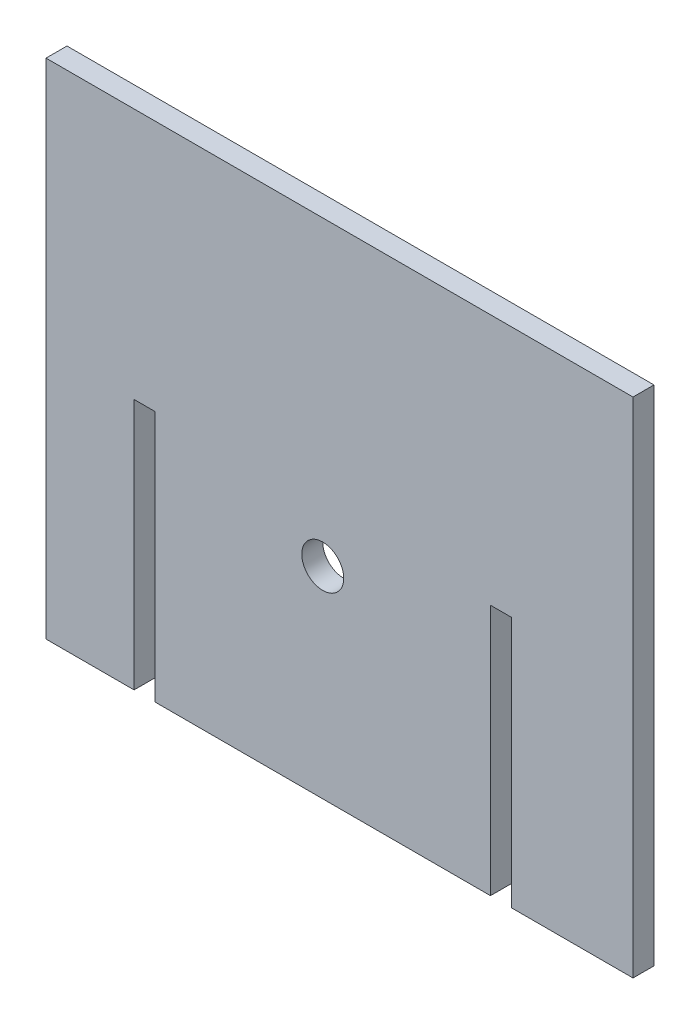
ISO-10303-21;
HEADER;
FILE_DESCRIPTION(('STEP AP214'),'2;1');
FILE_NAME('part.step','',(''),(''),'','','');
FILE_SCHEMA(('AUTOMOTIVE_DESIGN { 1 0 10303 214 1 1 1 1 }'));
ENDSEC;
DATA;
#1=APPLICATION_CONTEXT('core data for automotive mechanical design processes');
#2=APPLICATION_PROTOCOL_DEFINITION('international standard','automotive_design',2000,#1);
#3=PRODUCT_CONTEXT('',#1,'mechanical');
#4=PRODUCT('Part','Part','',(#3));
#5=PRODUCT_RELATED_PRODUCT_CATEGORY('part','',(#4));
#6=PRODUCT_DEFINITION_FORMATION('','',#4);
#7=PRODUCT_DEFINITION_CONTEXT('part definition',#1,'design');
#8=PRODUCT_DEFINITION('design','',#6,#7);
#9=PRODUCT_DEFINITION_SHAPE('','',#8);
#10=(LENGTH_UNIT() NAMED_UNIT(*) SI_UNIT(.MILLI.,.METRE.));
#11=(NAMED_UNIT(*) PLANE_ANGLE_UNIT() SI_UNIT($,.RADIAN.));
#12=(NAMED_UNIT(*) SI_UNIT($,.STERADIAN.) SOLID_ANGLE_UNIT());
#13=UNCERTAINTY_MEASURE_WITH_UNIT(LENGTH_MEASURE(1.E-05),#10,'distance_accuracy_value','');
#14=(GEOMETRIC_REPRESENTATION_CONTEXT(3) GLOBAL_UNCERTAINTY_ASSIGNED_CONTEXT((#13)) GLOBAL_UNIT_ASSIGNED_CONTEXT((#10,
#11,#12)) REPRESENTATION_CONTEXT('',''));
#15=CARTESIAN_POINT('',(0.,0.,0.));
#16=DIRECTION('',(0.,0.,1.));
#17=DIRECTION('',(1.,0.,0.));
#18=AXIS2_PLACEMENT_3D('',#15,#16,#17);
#19=CARTESIAN_POINT('',(785.699999999983,-3.43426074979514E-11,6.35));
#20=DIRECTION('',(1.,0.,0.));
#21=DIRECTION('',(0.,1.,0.));
#22=AXIS2_PLACEMENT_3D('',#19,#20,#21);
#23=PLANE('',#22);
#24=DIRECTION('',(0.,-1.,0.));
#25=VECTOR('',#24,1.);
#26=CARTESIAN_POINT('',(785.699999999983,-3.43426074979514E-11,-6.35));
#27=LINE('',#26,#25);
#28=CARTESIAN_POINT('',(785.700000000007,533.399999999962,-6.35));
#29=VERTEX_POINT('',#28);
#30=CARTESIAN_POINT('',(785.7,380.999999999962,-6.35));
#31=VERTEX_POINT('',#30);
#32=EDGE_CURVE('E167',#29,#31,#27,.T.);
#33=ORIENTED_EDGE('',*,*,#32,.F.);
#34=DIRECTION('',(0.,0.,-1.));
#35=VECTOR('',#34,1.);
#36=CARTESIAN_POINT('',(785.700000000007,533.399999999962,6.35));
#37=LINE('',#36,#35);
#38=CARTESIAN_POINT('',(785.700000000007,533.399999999962,6.35));
#39=VERTEX_POINT('',#38);
#40=EDGE_CURVE('E150',#39,#29,#37,.T.);
#41=ORIENTED_EDGE('',*,*,#40,.F.);
#42=DIRECTION('',(0.,-1.,0.));
#43=VECTOR('',#42,1.);
#44=CARTESIAN_POINT('',(785.699999999983,-3.43426074979514E-11,6.35));
#45=LINE('',#44,#43);
#46=CARTESIAN_POINT('',(785.7,380.999999999962,6.35));
#47=VERTEX_POINT('',#46);
#48=EDGE_CURVE('E203',#39,#47,#45,.T.);
#49=ORIENTED_EDGE('',*,*,#48,.T.);
#50=DIRECTION('',(0.,0.,-1.));
#51=VECTOR('',#50,1.);
#52=CARTESIAN_POINT('',(785.7,380.999999999962,6.35));
#53=LINE('',#52,#51);
#54=EDGE_CURVE('E154',#47,#31,#53,.T.);
#55=ORIENTED_EDGE('',*,*,#54,.T.);
#56=EDGE_LOOP('',(#33,#41,#49,#55));
#57=FACE_BOUND('',#56,.T.);
#58=ADVANCED_FACE('F41',(#57),#23,.T.);
#59=CARTESIAN_POINT('',(0.,533.399999999962,6.35));
#60=DIRECTION('',(0.,1.,0.));
#61=DIRECTION('',(0.,0.,1.));
#62=AXIS2_PLACEMENT_3D('',#59,#60,#61);
#63=PLANE('',#62);
#64=DIRECTION('',(1.,0.,0.));
#65=VECTOR('',#64,1.);
#66=CARTESIAN_POINT('',(0.,533.399999999962,-6.35));
#67=LINE('',#66,#65);
#68=CARTESIAN_POINT('',(798.399999999963,533.399999999962,-6.35));
#69=VERTEX_POINT('',#68);
#70=EDGE_CURVE('E147',#29,#69,#67,.T.);
#71=ORIENTED_EDGE('',*,*,#70,.T.);
#72=DIRECTION('',(0.,0.,-1.));
#73=VECTOR('',#72,1.);
#74=CARTESIAN_POINT('',(798.399999999963,533.399999999962,6.35));
#75=LINE('',#74,#73);
#76=CARTESIAN_POINT('',(798.399999999963,533.399999999962,6.35));
#77=VERTEX_POINT('',#76);
#78=EDGE_CURVE('E137',#77,#69,#75,.T.);
#79=ORIENTED_EDGE('',*,*,#78,.F.);
#80=DIRECTION('',(1.,0.,0.));
#81=VECTOR('',#80,1.);
#82=CARTESIAN_POINT('',(0.,533.399999999962,6.35));
#83=LINE('',#82,#81);
#84=EDGE_CURVE('E105',#39,#77,#83,.T.);
#85=ORIENTED_EDGE('',*,*,#84,.F.);
#86=ORIENTED_EDGE('',*,*,#40,.T.);
#87=EDGE_LOOP('',(#71,#79,#85,#86));
#88=FACE_BOUND('',#87,.T.);
#89=ADVANCED_FACE('F148',(#88),#63,.F.);
#90=CARTESIAN_POINT('',(798.399999999963,0.,6.35));
#91=DIRECTION('',(-1.,0.,0.));
#92=DIRECTION('',(0.,0.,1.));
#93=AXIS2_PLACEMENT_3D('',#90,#91,#92);
#94=PLANE('',#93);
#95=DIRECTION('',(0.,1.,0.));
#96=VECTOR('',#95,1.);
#97=CARTESIAN_POINT('',(798.399999999963,0.,-6.35));
#98=LINE('',#97,#96);
#99=CARTESIAN_POINT('',(798.399999999963,380.999999999962,-6.35));
#100=VERTEX_POINT('',#99);
#101=EDGE_CURVE('E51',#100,#69,#98,.T.);
#102=ORIENTED_EDGE('',*,*,#101,.F.);
#103=DIRECTION('',(0.,0.,-1.));
#104=VECTOR('',#103,1.);
#105=CARTESIAN_POINT('',(798.399999999963,380.999999999962,6.35));
#106=LINE('',#105,#104);
#107=CARTESIAN_POINT('',(798.399999999963,380.999999999962,6.35));
#108=VERTEX_POINT('',#107);
#109=EDGE_CURVE('E199',#108,#100,#106,.T.);
#110=ORIENTED_EDGE('',*,*,#109,.F.);
#111=DIRECTION('',(0.,1.,0.));
#112=VECTOR('',#111,1.);
#113=CARTESIAN_POINT('',(798.399999999963,0.,6.35));
#114=LINE('',#113,#112);
#115=EDGE_CURVE('E141',#108,#77,#114,.T.);
#116=ORIENTED_EDGE('',*,*,#115,.T.);
#117=ORIENTED_EDGE('',*,*,#78,.T.);
#118=EDGE_LOOP('',(#102,#110,#116,#117));
#119=FACE_BOUND('',#118,.T.);
#120=ADVANCED_FACE('F139',(#119),#94,.T.);
#121=CARTESIAN_POINT('',(0.,380.999999999962,6.35));
#122=DIRECTION('',(0.,1.,0.));
#123=DIRECTION('',(0.,0.,1.));
#124=AXIS2_PLACEMENT_3D('',#121,#122,#123);
#125=PLANE('',#124);
#126=DIRECTION('',(1.,0.,0.));
#127=VECTOR('',#126,1.);
#128=CARTESIAN_POINT('',(0.,380.999999999962,-6.35));
#129=LINE('',#128,#127);
#130=CARTESIAN_POINT('',(1001.6,380.999999999962,-6.35));
#131=VERTEX_POINT('',#130);
#132=EDGE_CURVE('E143',#100,#131,#129,.T.);
#133=ORIENTED_EDGE('',*,*,#132,.T.);
#134=DIRECTION('',(0.,0.,-1.));
#135=VECTOR('',#134,1.);
#136=CARTESIAN_POINT('',(1001.6,380.999999999962,6.35));
#137=LINE('',#136,#135);
#138=CARTESIAN_POINT('',(1001.6,380.999999999962,6.35));
#139=VERTEX_POINT('',#138);
#140=EDGE_CURVE('E198',#139,#131,#137,.T.);
#141=ORIENTED_EDGE('',*,*,#140,.F.);
#142=DIRECTION('',(1.,0.,0.));
#143=VECTOR('',#142,1.);
#144=CARTESIAN_POINT('',(0.,380.999999999962,6.35));
#145=LINE('',#144,#143);
#146=EDGE_CURVE('E193',#108,#139,#145,.T.);
#147=ORIENTED_EDGE('',*,*,#146,.F.);
#148=ORIENTED_EDGE('',*,*,#109,.T.);
#149=EDGE_LOOP('',(#133,#141,#147,#148));
#150=FACE_BOUND('',#149,.T.);
#151=ADVANCED_FACE('F286',(#150),#125,.F.);
#152=CARTESIAN_POINT('',(1001.59999999998,-3.79422361129631E-11,6.35));
#153=DIRECTION('',(1.,0.,0.));
#154=DIRECTION('',(0.,1.,0.));
#155=AXIS2_PLACEMENT_3D('',#152,#153,#154);
#156=PLANE('',#155);
#157=DIRECTION('',(0.,-1.,0.));
#158=VECTOR('',#157,1.);
#159=CARTESIAN_POINT('',(1001.59999999998,-3.79422361129631E-11,-6.35));
#160=LINE('',#159,#158);
#161=CARTESIAN_POINT('',(1001.6,533.399999999962,-6.35));
#162=VERTEX_POINT('',#161);
#163=EDGE_CURVE('E160',#162,#131,#160,.T.);
#164=ORIENTED_EDGE('',*,*,#163,.F.);
#165=DIRECTION('',(0.,0.,-1.));
#166=VECTOR('',#165,1.);
#167=CARTESIAN_POINT('',(1001.6,533.399999999962,6.35));
#168=LINE('',#167,#166);
#169=CARTESIAN_POINT('',(1001.6,533.399999999962,6.35));
#170=VERTEX_POINT('',#169);
#171=EDGE_CURVE('E191',#170,#162,#168,.T.);
#172=ORIENTED_EDGE('',*,*,#171,.F.);
#173=DIRECTION('',(0.,-1.,0.));
#174=VECTOR('',#173,1.);
#175=CARTESIAN_POINT('',(1001.59999999998,-3.79422361129631E-11,6.35));
#176=LINE('',#175,#174);
#177=EDGE_CURVE('E194',#170,#139,#176,.T.);
#178=ORIENTED_EDGE('',*,*,#177,.T.);
#179=ORIENTED_EDGE('',*,*,#140,.T.);
#180=EDGE_LOOP('',(#164,#172,#178,#179));
#181=FACE_BOUND('',#180,.T.);
#182=ADVANCED_FACE('F289',(#181),#156,.T.);
#183=CARTESIAN_POINT('',(0.,533.399999999962,6.35));
#184=DIRECTION('',(0.,1.,0.));
#185=DIRECTION('',(0.,0.,1.));
#186=AXIS2_PLACEMENT_3D('',#183,#184,#185);
#187=PLANE('',#186);
#188=DIRECTION('',(1.,0.,0.));
#189=VECTOR('',#188,1.);
#190=CARTESIAN_POINT('',(0.,533.399999999962,-6.35));
#191=LINE('',#190,#189);
#192=CARTESIAN_POINT('',(1014.29999999996,533.399999999962,-6.35));
#193=VERTEX_POINT('',#192);
#194=EDGE_CURVE('E230',#162,#193,#191,.T.);
#195=ORIENTED_EDGE('',*,*,#194,.T.);
#196=DIRECTION('',(0.,0.,-1.));
#197=VECTOR('',#196,1.);
#198=CARTESIAN_POINT('',(1014.29999999996,533.399999999962,6.35));
#199=LINE('',#198,#197);
#200=CARTESIAN_POINT('',(1014.29999999996,533.399999999962,6.35));
#201=VERTEX_POINT('',#200);
#202=EDGE_CURVE('E190',#201,#193,#199,.T.);
#203=ORIENTED_EDGE('',*,*,#202,.F.);
#204=DIRECTION('',(1.,0.,0.));
#205=VECTOR('',#204,1.);
#206=CARTESIAN_POINT('',(0.,533.399999999962,6.35));
#207=LINE('',#206,#205);
#208=EDGE_CURVE('E185',#170,#201,#207,.T.);
#209=ORIENTED_EDGE('',*,*,#208,.F.);
#210=ORIENTED_EDGE('',*,*,#171,.T.);
#211=EDGE_LOOP('',(#195,#203,#209,#210));
#212=FACE_BOUND('',#211,.T.);
#213=ADVANCED_FACE('F293',(#212),#187,.F.);
#214=CARTESIAN_POINT('',(1014.29999999996,0.,6.35));
#215=DIRECTION('',(-1.,0.,0.));
#216=DIRECTION('',(0.,0.,1.));
#217=AXIS2_PLACEMENT_3D('',#214,#215,#216);
#218=PLANE('',#217);
#219=DIRECTION('',(0.,1.,0.));
#220=VECTOR('',#219,1.);
#221=CARTESIAN_POINT('',(1014.29999999996,0.,-6.35));
#222=LINE('',#221,#220);
#223=CARTESIAN_POINT('',(1014.29999999996,380.999999999962,-6.35));
#224=VERTEX_POINT('',#223);
#225=EDGE_CURVE('E163',#224,#193,#222,.T.);
#226=ORIENTED_EDGE('',*,*,#225,.F.);
#227=DIRECTION('',(0.,0.,-1.));
#228=VECTOR('',#227,1.);
#229=CARTESIAN_POINT('',(1014.29999999996,380.999999999962,6.35));
#230=LINE('',#229,#228);
#231=CARTESIAN_POINT('',(1014.29999999996,380.999999999962,6.35));
#232=VERTEX_POINT('',#231);
#233=EDGE_CURVE('E182',#232,#224,#230,.T.);
#234=ORIENTED_EDGE('',*,*,#233,.F.);
#235=DIRECTION('',(0.,1.,0.));
#236=VECTOR('',#235,1.);
#237=CARTESIAN_POINT('',(1014.29999999996,0.,6.35));
#238=LINE('',#237,#236);
#239=EDGE_CURVE('E186',#232,#201,#238,.T.);
#240=ORIENTED_EDGE('',*,*,#239,.T.);
#241=ORIENTED_EDGE('',*,*,#202,.T.);
#242=EDGE_LOOP('',(#226,#234,#240,#241));
#243=FACE_BOUND('',#242,.T.);
#244=ADVANCED_FACE('F296',(#243),#218,.T.);
#245=CARTESIAN_POINT('',(0.,380.999999999962,6.35));
#246=DIRECTION('',(0.,1.,0.));
#247=DIRECTION('',(0.,0.,1.));
#248=AXIS2_PLACEMENT_3D('',#245,#246,#247);
#249=PLANE('',#248);
#250=DIRECTION('',(1.,0.,0.));
#251=VECTOR('',#250,1.);
#252=CARTESIAN_POINT('',(0.,380.999999999962,-6.35));
#253=LINE('',#252,#251);
#254=CARTESIAN_POINT('',(1087.95999999996,380.999999999962,-6.35));
#255=VERTEX_POINT('',#254);
#256=EDGE_CURVE('E223',#224,#255,#253,.T.);
#257=ORIENTED_EDGE('',*,*,#256,.T.);
#258=DIRECTION('',(0.,0.,-1.));
#259=VECTOR('',#258,1.);
#260=CARTESIAN_POINT('',(1087.95999999996,380.999999999962,6.35));
#261=LINE('',#260,#259);
#262=CARTESIAN_POINT('',(1087.95999999996,380.999999999962,6.35));
#263=VERTEX_POINT('',#262);
#264=EDGE_CURVE('E178',#263,#255,#261,.T.);
#265=ORIENTED_EDGE('',*,*,#264,.F.);
#266=DIRECTION('',(1.,0.,0.));
#267=VECTOR('',#266,1.);
#268=CARTESIAN_POINT('',(0.,380.999999999962,6.35));
#269=LINE('',#268,#267);
#270=EDGE_CURVE('E173',#232,#263,#269,.T.);
#271=ORIENTED_EDGE('',*,*,#270,.F.);
#272=ORIENTED_EDGE('',*,*,#233,.T.);
#273=EDGE_LOOP('',(#257,#265,#271,#272));
#274=FACE_BOUND('',#273,.T.);
#275=ADVANCED_FACE('F299',(#274),#249,.F.);
#276=CARTESIAN_POINT('',(1087.95999999996,0.,6.35));
#277=DIRECTION('',(1.,0.,0.));
#278=DIRECTION('',(0.,0.,-1.));
#279=AXIS2_PLACEMENT_3D('',#276,#277,#278);
#280=PLANE('',#279);
#281=DIRECTION('',(0.,-1.,0.));
#282=VECTOR('',#281,1.);
#283=CARTESIAN_POINT('',(1087.95999999996,0.,-6.35));
#284=LINE('',#283,#282);
#285=CARTESIAN_POINT('',(1087.95999999996,685.799999999962,-6.35));
#286=VERTEX_POINT('',#285);
#287=EDGE_CURVE('E220',#286,#255,#284,.T.);
#288=ORIENTED_EDGE('',*,*,#287,.F.);
#289=DIRECTION('',(0.,0.,-1.));
#290=VECTOR('',#289,1.);
#291=CARTESIAN_POINT('',(1087.95999999996,685.799999999962,6.35));
#292=LINE('',#291,#290);
#293=CARTESIAN_POINT('',(1087.95999999996,685.799999999962,6.35));
#294=VERTEX_POINT('',#293);
#295=EDGE_CURVE('E177',#294,#286,#292,.T.);
#296=ORIENTED_EDGE('',*,*,#295,.F.);
#297=DIRECTION('',(0.,-1.,0.));
#298=VECTOR('',#297,1.);
#299=CARTESIAN_POINT('',(1087.95999999996,0.,6.35));
#300=LINE('',#299,#298);
#301=EDGE_CURVE('E179',#294,#263,#300,.T.);
#302=ORIENTED_EDGE('',*,*,#301,.T.);
#303=ORIENTED_EDGE('',*,*,#264,.T.);
#304=EDGE_LOOP('',(#288,#296,#302,#303));
#305=FACE_BOUND('',#304,.T.);
#306=ADVANCED_FACE('F254',(#305),#280,.T.);
#307=CARTESIAN_POINT('',(4.4082384801313E-12,685.799999999969,6.35));
#308=DIRECTION('',(0.,1.,0.));
#309=DIRECTION('',(-1.,0.,0.));
#310=AXIS2_PLACEMENT_3D('',#307,#308,#309);
#311=PLANE('',#310);
#312=DIRECTION('',(1.,0.,0.));
#313=VECTOR('',#312,1.);
#314=CARTESIAN_POINT('',(4.4082384801313E-12,685.799999999969,-6.35));
#315=LINE('',#314,#313);
#316=CARTESIAN_POINT('',(732.359999999964,685.799999999962,-6.35));
#317=VERTEX_POINT('',#316);
#318=EDGE_CURVE('E169',#317,#286,#315,.T.);
#319=ORIENTED_EDGE('',*,*,#318,.F.);
#320=DIRECTION('',(0.,0.,-1.));
#321=VECTOR('',#320,1.);
#322=CARTESIAN_POINT('',(732.359999999964,685.799999999962,6.35));
#323=LINE('',#322,#321);
#324=CARTESIAN_POINT('',(732.359999999964,685.799999999962,6.35));
#325=VERTEX_POINT('',#324);
#326=EDGE_CURVE('E113',#325,#317,#323,.T.);
#327=ORIENTED_EDGE('',*,*,#326,.F.);
#328=DIRECTION('',(1.,0.,0.));
#329=VECTOR('',#328,1.);
#330=CARTESIAN_POINT('',(4.4082384801313E-12,685.799999999969,6.35));
#331=LINE('',#330,#329);
#332=EDGE_CURVE('E174',#325,#294,#331,.T.);
#333=ORIENTED_EDGE('',*,*,#332,.T.);
#334=ORIENTED_EDGE('',*,*,#295,.T.);
#335=EDGE_LOOP('',(#319,#327,#333,#334));
#336=FACE_BOUND('',#335,.T.);
#337=ADVANCED_FACE('F250',(#336),#311,.T.);
#338=CARTESIAN_POINT('',(732.359999999964,0.,6.35));
#339=DIRECTION('',(1.,0.,0.));
#340=DIRECTION('',(0.,0.,-1.));
#341=AXIS2_PLACEMENT_3D('',#338,#339,#340);
#342=PLANE('',#341);
#343=DIRECTION('',(0.,-1.,0.));
#344=VECTOR('',#343,1.);
#345=CARTESIAN_POINT('',(732.359999999964,0.,-6.35));
#346=LINE('',#345,#344);
#347=CARTESIAN_POINT('',(732.359999999964,380.999999999962,-6.35));
#348=VERTEX_POINT('',#347);
#349=EDGE_CURVE('E216',#317,#348,#346,.T.);
#350=ORIENTED_EDGE('',*,*,#349,.T.);
#351=DIRECTION('',(0.,0.,-1.));
#352=VECTOR('',#351,1.);
#353=CARTESIAN_POINT('',(732.359999999964,380.999999999962,6.35));
#354=LINE('',#353,#352);
#355=CARTESIAN_POINT('',(732.359999999964,380.999999999962,6.35));
#356=VERTEX_POINT('',#355);
#357=EDGE_CURVE('E212',#356,#348,#354,.T.);
#358=ORIENTED_EDGE('',*,*,#357,.F.);
#359=DIRECTION('',(0.,-1.,0.));
#360=VECTOR('',#359,1.);
#361=CARTESIAN_POINT('',(732.359999999964,0.,6.35));
#362=LINE('',#361,#360);
#363=EDGE_CURVE('E171',#325,#356,#362,.T.);
#364=ORIENTED_EDGE('',*,*,#363,.F.);
#365=ORIENTED_EDGE('',*,*,#326,.T.);
#366=EDGE_LOOP('',(#350,#358,#364,#365));
#367=FACE_BOUND('',#366,.T.);
#368=ADVANCED_FACE('F260',(#367),#342,.F.);
#369=CARTESIAN_POINT('',(0.,380.999999999962,6.35));
#370=DIRECTION('',(0.,1.,0.));
#371=DIRECTION('',(0.,0.,1.));
#372=AXIS2_PLACEMENT_3D('',#369,#370,#371);
#373=PLANE('',#372);
#374=DIRECTION('',(1.,0.,0.));
#375=VECTOR('',#374,1.);
#376=CARTESIAN_POINT('',(0.,380.999999999962,-6.35));
#377=LINE('',#376,#375);
#378=EDGE_CURVE('E214',#348,#31,#377,.T.);
#379=ORIENTED_EDGE('',*,*,#378,.T.);
#380=ORIENTED_EDGE('',*,*,#54,.F.);
#381=DIRECTION('',(1.,0.,0.));
#382=VECTOR('',#381,1.);
#383=CARTESIAN_POINT('',(0.,380.999999999962,6.35));
#384=LINE('',#383,#382);
#385=EDGE_CURVE('E60',#356,#47,#384,.T.);
#386=ORIENTED_EDGE('',*,*,#385,.F.);
#387=ORIENTED_EDGE('',*,*,#357,.T.);
#388=EDGE_LOOP('',(#379,#380,#386,#387));
#389=FACE_BOUND('',#388,.T.);
#390=ADVANCED_FACE('F262',(#389),#373,.F.);
#391=CARTESIAN_POINT('',(0.,0.,6.35));
#392=DIRECTION('',(0.,0.,1.));
#393=DIRECTION('',(1.,0.,0.));
#394=AXIS2_PLACEMENT_3D('',#391,#392,#393);
#395=PLANE('',#394);
#396=CARTESIAN_POINT('',(900.,503.049546279118,6.34999999999999));
#397=DIRECTION('',(0.,0.,1.));
#398=DIRECTION('',(1.,0.,0.));
#399=AXIS2_PLACEMENT_3D('',#396,#397,#398);
#400=CIRCLE('',#399,12.7);
#401=CARTESIAN_POINT('',(912.7,503.049546279118,6.34999999999999));
#402=VERTEX_POINT('',#401);
#403=EDGE_CURVE('E45',#402,#402,#400,.F.);
#404=ORIENTED_EDGE('',*,*,#403,.T.);
#405=EDGE_LOOP('',(#404));
#406=FACE_BOUND('',#405,.T.);
#407=ORIENTED_EDGE('',*,*,#48,.F.);
#408=ORIENTED_EDGE('',*,*,#84,.T.);
#409=ORIENTED_EDGE('',*,*,#115,.F.);
#410=ORIENTED_EDGE('',*,*,#146,.T.);
#411=ORIENTED_EDGE('',*,*,#177,.F.);
#412=ORIENTED_EDGE('',*,*,#208,.T.);
#413=ORIENTED_EDGE('',*,*,#239,.F.);
#414=ORIENTED_EDGE('',*,*,#270,.T.);
#415=ORIENTED_EDGE('',*,*,#301,.F.);
#416=ORIENTED_EDGE('',*,*,#332,.F.);
#417=ORIENTED_EDGE('',*,*,#363,.T.);
#418=ORIENTED_EDGE('',*,*,#385,.T.);
#419=EDGE_LOOP('',(#407,#408,#409,#410,#411,#412,#413,#414,#415,#416,#417,#418));
#420=FACE_BOUND('',#419,.T.);
#421=ADVANCED_FACE('F43',(#406,#420),#395,.T.);
#422=CARTESIAN_POINT('',(0.,0.,-6.35));
#423=DIRECTION('',(0.,0.,1.));
#424=DIRECTION('',(1.,0.,0.));
#425=AXIS2_PLACEMENT_3D('',#422,#423,#424);
#426=PLANE('',#425);
#427=CARTESIAN_POINT('',(900.,503.049546279118,-6.34999999999999));
#428=DIRECTION('',(0.,0.,1.));
#429=DIRECTION('',(1.,0.,0.));
#430=AXIS2_PLACEMENT_3D('',#427,#428,#429);
#431=CIRCLE('',#430,12.7);
#432=CARTESIAN_POINT('',(912.7,503.049546279118,-6.34999999999999));
#433=VERTEX_POINT('',#432);
#434=EDGE_CURVE('E11',#433,#433,#431,.F.);
#435=ORIENTED_EDGE('',*,*,#434,.F.);
#436=EDGE_LOOP('',(#435));
#437=FACE_BOUND('',#436,.T.);
#438=ORIENTED_EDGE('',*,*,#32,.T.);
#439=ORIENTED_EDGE('',*,*,#378,.F.);
#440=ORIENTED_EDGE('',*,*,#349,.F.);
#441=ORIENTED_EDGE('',*,*,#318,.T.);
#442=ORIENTED_EDGE('',*,*,#287,.T.);
#443=ORIENTED_EDGE('',*,*,#256,.F.);
#444=ORIENTED_EDGE('',*,*,#225,.T.);
#445=ORIENTED_EDGE('',*,*,#194,.F.);
#446=ORIENTED_EDGE('',*,*,#163,.T.);
#447=ORIENTED_EDGE('',*,*,#132,.F.);
#448=ORIENTED_EDGE('',*,*,#101,.T.);
#449=ORIENTED_EDGE('',*,*,#70,.F.);
#450=EDGE_LOOP('',(#438,#439,#440,#441,#442,#443,#444,#445,#446,#447,#448,#449));
#451=FACE_BOUND('',#450,.T.);
#452=ADVANCED_FACE('F157',(#437,#451),#426,.F.);
#453=CARTESIAN_POINT('',(900.,503.049546279118,167.449999999999));
#454=DIRECTION('',(0.,0.,-1.));
#455=DIRECTION('',(-1.,0.,0.));
#456=AXIS2_PLACEMENT_3D('',#453,#454,#455);
#457=CYLINDRICAL_SURFACE('',#456,12.7);
#458=ORIENTED_EDGE('',*,*,#403,.F.);
#459=EDGE_LOOP('',(#458));
#460=FACE_BOUND('',#459,.T.);
#461=ORIENTED_EDGE('',*,*,#434,.T.);
#462=EDGE_LOOP('',(#461));
#463=FACE_BOUND('',#462,.T.);
#464=ADVANCED_FACE('F267',(#460,#463),#457,.F.);
#465=CLOSED_SHELL('',(#58,#89,#120,#151,#182,#213,#244,#275,#306,#337,#368,#390,#421,#452,#464));
#466=MANIFOLD_SOLID_BREP('B2',#465);
#467=ADVANCED_BREP_SHAPE_REPRESENTATION('',(#18,#466),#14);
#468=SHAPE_DEFINITION_REPRESENTATION(#9,#467);
ENDSEC;
END-ISO-10303-21;
